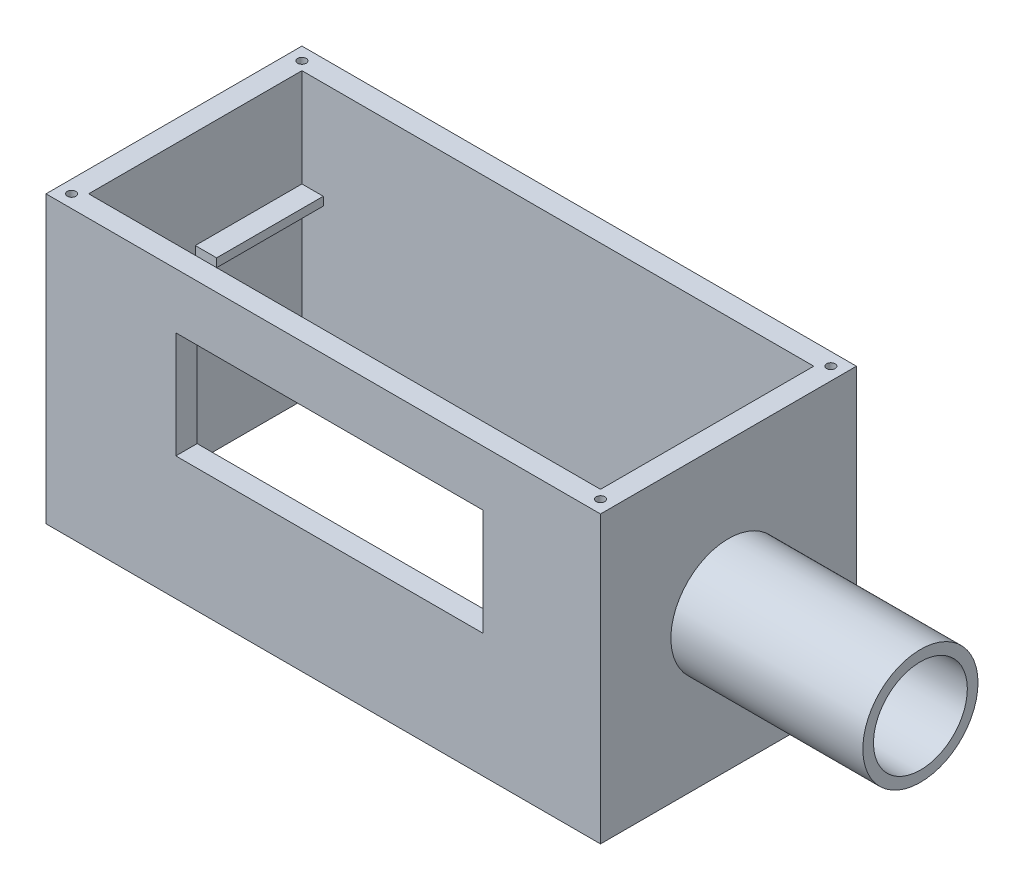
ISO-10303-21;
HEADER;
FILE_DESCRIPTION(('STEP AP214'),'2;1');
FILE_NAME('part.step','',(''),(''),'','','');
FILE_SCHEMA(('AUTOMOTIVE_DESIGN { 1 0 10303 214 1 1 1 1 }'));
ENDSEC;
DATA;
#1=APPLICATION_CONTEXT('core data for automotive mechanical design processes');
#2=APPLICATION_PROTOCOL_DEFINITION('international standard','automotive_design',2000,#1);
#3=PRODUCT_CONTEXT('',#1,'mechanical');
#4=PRODUCT('Part','Part','',(#3));
#5=PRODUCT_RELATED_PRODUCT_CATEGORY('part','',(#4));
#6=PRODUCT_DEFINITION_FORMATION('','',#4);
#7=PRODUCT_DEFINITION_CONTEXT('part definition',#1,'design');
#8=PRODUCT_DEFINITION('design','',#6,#7);
#9=PRODUCT_DEFINITION_SHAPE('','',#8);
#10=(LENGTH_UNIT() NAMED_UNIT(*) SI_UNIT(.MILLI.,.METRE.));
#11=(NAMED_UNIT(*) PLANE_ANGLE_UNIT() SI_UNIT($,.RADIAN.));
#12=(NAMED_UNIT(*) SI_UNIT($,.STERADIAN.) SOLID_ANGLE_UNIT());
#13=UNCERTAINTY_MEASURE_WITH_UNIT(LENGTH_MEASURE(1.E-05),#10,'distance_accuracy_value','');
#14=(GEOMETRIC_REPRESENTATION_CONTEXT(3) GLOBAL_UNCERTAINTY_ASSIGNED_CONTEXT((#13)) GLOBAL_UNIT_ASSIGNED_CONTEXT((#10,
#11,#12)) REPRESENTATION_CONTEXT('',''));
#15=CARTESIAN_POINT('',(0.,0.,0.));
#16=DIRECTION('',(0.,0.,1.));
#17=DIRECTION('',(1.,0.,0.));
#18=AXIS2_PLACEMENT_3D('',#15,#16,#17);
#19=CARTESIAN_POINT('',(-60.,-0.001000000000001,-25.));
#20=DIRECTION('',(0.,0.,-1.));
#21=DIRECTION('',(-1.,0.,0.));
#22=AXIS2_PLACEMENT_3D('',#19,#20,#21);
#23=PLANE('',#22);
#24=DIRECTION('',(1.,0.,0.));
#25=VECTOR('',#24,1.);
#26=CARTESIAN_POINT('',(-60.,42.,-25.));
#27=LINE('',#26,#25);
#28=CARTESIAN_POINT('',(-60.,42.,-25.));
#29=VERTEX_POINT('',#28);
#30=CARTESIAN_POINT('',(-55.,42.,-25.));
#31=VERTEX_POINT('',#30);
#32=EDGE_CURVE('E244',#29,#31,#27,.T.);
#33=ORIENTED_EDGE('',*,*,#32,.F.);
#34=DIRECTION('',(0.,1.,0.));
#35=VECTOR('',#34,1.);
#36=CARTESIAN_POINT('',(-60.,-0.001000000000001,-25.));
#37=LINE('',#36,#35);
#38=CARTESIAN_POINT('',(-60.,0.,-25.));
#39=VERTEX_POINT('',#38);
#40=EDGE_CURVE('E313',#39,#29,#37,.T.);
#41=ORIENTED_EDGE('',*,*,#40,.F.);
#42=DIRECTION('',(1.,0.,0.));
#43=VECTOR('',#42,1.);
#44=CARTESIAN_POINT('',(-60.,0.,-25.));
#45=LINE('',#44,#43);
#46=CARTESIAN_POINT('',(60.,0.,-25.));
#47=VERTEX_POINT('',#46);
#48=EDGE_CURVE('E309',#39,#47,#45,.T.);
#49=ORIENTED_EDGE('',*,*,#48,.T.);
#50=DIRECTION('',(0.,1.,0.));
#51=VECTOR('',#50,1.);
#52=CARTESIAN_POINT('',(60.,-0.001000000000001,-25.));
#53=LINE('',#52,#51);
#54=CARTESIAN_POINT('',(60.,42.,-25.));
#55=VERTEX_POINT('',#54);
#56=EDGE_CURVE('E318',#47,#55,#53,.T.);
#57=ORIENTED_EDGE('',*,*,#56,.T.);
#58=DIRECTION('',(1.,0.,0.));
#59=VECTOR('',#58,1.);
#60=CARTESIAN_POINT('',(-60.,42.,-25.));
#61=LINE('',#60,#59);
#62=CARTESIAN_POINT('',(55.,42.,-25.));
#63=VERTEX_POINT('',#62);
#64=EDGE_CURVE('E375',#63,#55,#61,.T.);
#65=ORIENTED_EDGE('',*,*,#64,.F.);
#66=DIRECTION('',(0.,-1.,0.));
#67=VECTOR('',#66,1.);
#68=CARTESIAN_POINT('',(55.,-0.001000000000001,-25.));
#69=LINE('',#68,#67);
#70=CARTESIAN_POINT('',(55.,44.,-25.));
#71=VERTEX_POINT('',#70);
#72=EDGE_CURVE('E367',#71,#63,#69,.T.);
#73=ORIENTED_EDGE('',*,*,#72,.F.);
#74=DIRECTION('',(-1.,0.,0.));
#75=VECTOR('',#74,1.);
#76=CARTESIAN_POINT('',(-60.,44.,-25.));
#77=LINE('',#76,#75);
#78=CARTESIAN_POINT('',(60.,44.,-25.));
#79=VERTEX_POINT('',#78);
#80=EDGE_CURVE('E371',#79,#71,#77,.T.);
#81=ORIENTED_EDGE('',*,*,#80,.F.);
#82=CARTESIAN_POINT('',(60.,67.,-25.));
#83=VERTEX_POINT('',#82);
#84=EDGE_CURVE('E305',#79,#83,#53,.T.);
#85=ORIENTED_EDGE('',*,*,#84,.T.);
#86=DIRECTION('',(-1.,0.,0.));
#87=VECTOR('',#86,1.);
#88=CARTESIAN_POINT('',(-60.,67.,-25.));
#89=LINE('',#88,#87);
#90=CARTESIAN_POINT('',(-60.,67.,-25.));
#91=VERTEX_POINT('',#90);
#92=EDGE_CURVE('E293',#83,#91,#89,.T.);
#93=ORIENTED_EDGE('',*,*,#92,.T.);
#94=CARTESIAN_POINT('',(-60.,44.,-25.));
#95=VERTEX_POINT('',#94);
#96=EDGE_CURVE('E317',#95,#91,#37,.T.);
#97=ORIENTED_EDGE('',*,*,#96,.F.);
#98=DIRECTION('',(-1.,0.,0.));
#99=VECTOR('',#98,1.);
#100=CARTESIAN_POINT('',(-60.,44.,-25.));
#101=LINE('',#100,#99);
#102=CARTESIAN_POINT('',(-55.,44.,-25.));
#103=VERTEX_POINT('',#102);
#104=EDGE_CURVE('E240',#103,#95,#101,.T.);
#105=ORIENTED_EDGE('',*,*,#104,.F.);
#106=DIRECTION('',(0.,-1.,0.));
#107=VECTOR('',#106,1.);
#108=CARTESIAN_POINT('',(-55.,-0.001000000000001,-25.));
#109=LINE('',#108,#107);
#110=EDGE_CURVE('E43',#103,#31,#109,.T.);
#111=ORIENTED_EDGE('',*,*,#110,.T.);
#112=EDGE_LOOP('',(#33,#41,#49,#57,#65,#73,#81,#85,#93,#97,#105,#111));
#113=FACE_BOUND('',#112,.T.);
#114=ADVANCED_FACE('F39',(#113),#23,.F.);
#115=CARTESIAN_POINT('',(-60.,-0.001000000000001,-25.));
#116=DIRECTION('',(-1.,0.,0.));
#117=DIRECTION('',(0.,0.,1.));
#118=AXIS2_PLACEMENT_3D('',#115,#116,#117);
#119=PLANE('',#118);
#120=DIRECTION('',(0.,0.,-1.));
#121=VECTOR('',#120,1.);
#122=CARTESIAN_POINT('',(-60.,42.,0.));
#123=LINE('',#122,#121);
#124=CARTESIAN_POINT('',(-60.,42.,0.));
#125=VERTEX_POINT('',#124);
#126=EDGE_CURVE('E219',#125,#29,#123,.T.);
#127=ORIENTED_EDGE('',*,*,#126,.F.);
#128=DIRECTION('',(0.,-1.,0.));
#129=VECTOR('',#128,1.);
#130=CARTESIAN_POINT('',(-60.,44.,0.));
#131=LINE('',#130,#129);
#132=CARTESIAN_POINT('',(-60.,44.,0.));
#133=VERTEX_POINT('',#132);
#134=EDGE_CURVE('E213',#133,#125,#131,.T.);
#135=ORIENTED_EDGE('',*,*,#134,.F.);
#136=DIRECTION('',(0.,0.,1.));
#137=VECTOR('',#136,1.);
#138=CARTESIAN_POINT('',(-60.,44.,-25.));
#139=LINE('',#138,#137);
#140=EDGE_CURVE('E378',#95,#133,#139,.T.);
#141=ORIENTED_EDGE('',*,*,#140,.F.);
#142=ORIENTED_EDGE('',*,*,#96,.T.);
#143=DIRECTION('',(0.,0.,1.));
#144=VECTOR('',#143,1.);
#145=CARTESIAN_POINT('',(-60.,67.,-25.));
#146=LINE('',#145,#144);
#147=CARTESIAN_POINT('',(-60.,67.,25.));
#148=VERTEX_POINT('',#147);
#149=EDGE_CURVE('E297',#91,#148,#146,.T.);
#150=ORIENTED_EDGE('',*,*,#149,.T.);
#151=DIRECTION('',(0.,1.,0.));
#152=VECTOR('',#151,1.);
#153=CARTESIAN_POINT('',(-60.,-0.001000000000001,25.));
#154=LINE('',#153,#152);
#155=CARTESIAN_POINT('',(-60.,0.,25.));
#156=VERTEX_POINT('',#155);
#157=EDGE_CURVE('E310',#156,#148,#154,.T.);
#158=ORIENTED_EDGE('',*,*,#157,.F.);
#159=DIRECTION('',(0.,0.,-1.));
#160=VECTOR('',#159,1.);
#161=CARTESIAN_POINT('',(-60.,0.,-25.));
#162=LINE('',#161,#160);
#163=EDGE_CURVE('E278',#156,#39,#162,.T.);
#164=ORIENTED_EDGE('',*,*,#163,.T.);
#165=ORIENTED_EDGE('',*,*,#40,.T.);
#166=EDGE_LOOP('',(#127,#135,#141,#142,#150,#158,#164,#165));
#167=FACE_BOUND('',#166,.T.);
#168=ADVANCED_FACE('F398',(#167),#119,.F.);
#169=CARTESIAN_POINT('',(60.,-0.001000000000001,-25.));
#170=DIRECTION('',(1.,0.,0.));
#171=DIRECTION('',(0.,0.,-1.));
#172=AXIS2_PLACEMENT_3D('',#169,#170,#171);
#173=PLANE('',#172);
#174=DIRECTION('',(0.,0.,1.));
#175=VECTOR('',#174,1.);
#176=CARTESIAN_POINT('',(60.,42.,0.238428507227939));
#177=LINE('',#176,#175);
#178=CARTESIAN_POINT('',(60.,42.,0.238428507227941));
#179=VERTEX_POINT('',#178);
#180=EDGE_CURVE('E248',#55,#179,#177,.T.);
#181=ORIENTED_EDGE('',*,*,#180,.F.);
#182=ORIENTED_EDGE('',*,*,#56,.F.);
#183=DIRECTION('',(0.,0.,1.));
#184=VECTOR('',#183,1.);
#185=CARTESIAN_POINT('',(60.,0.,-25.));
#186=LINE('',#185,#184);
#187=CARTESIAN_POINT('',(60.,0.,25.));
#188=VERTEX_POINT('',#187);
#189=EDGE_CURVE('E285',#47,#188,#186,.T.);
#190=ORIENTED_EDGE('',*,*,#189,.T.);
#191=DIRECTION('',(0.,1.,0.));
#192=VECTOR('',#191,1.);
#193=CARTESIAN_POINT('',(60.,-0.001000000000001,25.));
#194=LINE('',#193,#192);
#195=CARTESIAN_POINT('',(60.,67.,25.));
#196=VERTEX_POINT('',#195);
#197=EDGE_CURVE('E306',#188,#196,#194,.T.);
#198=ORIENTED_EDGE('',*,*,#197,.T.);
#199=DIRECTION('',(0.,0.,-1.));
#200=VECTOR('',#199,1.);
#201=CARTESIAN_POINT('',(60.,67.,-25.));
#202=LINE('',#201,#200);
#203=EDGE_CURVE('E289',#196,#83,#202,.T.);
#204=ORIENTED_EDGE('',*,*,#203,.T.);
#205=ORIENTED_EDGE('',*,*,#84,.F.);
#206=DIRECTION('',(0.,0.,-1.));
#207=VECTOR('',#206,1.);
#208=CARTESIAN_POINT('',(60.,44.,0.238428507227939));
#209=LINE('',#208,#207);
#210=CARTESIAN_POINT('',(60.,44.,0.238428507227939));
#211=VERTEX_POINT('',#210);
#212=EDGE_CURVE('E253',#211,#79,#209,.T.);
#213=ORIENTED_EDGE('',*,*,#212,.F.);
#214=DIRECTION('',(0.,1.,0.));
#215=VECTOR('',#214,1.);
#216=CARTESIAN_POINT('',(60.,44.,0.238428507227939));
#217=LINE('',#216,#215);
#218=EDGE_CURVE('E264',#179,#211,#217,.T.);
#219=ORIENTED_EDGE('',*,*,#218,.F.);
#220=EDGE_LOOP('',(#181,#182,#190,#198,#204,#205,#213,#219));
#221=FACE_BOUND('',#220,.T.);
#222=ADVANCED_FACE('F407',(#221),#173,.F.);
#223=CARTESIAN_POINT('',(65.,67.,-30.));
#224=DIRECTION('',(-1.,0.,0.));
#225=DIRECTION('',(0.,0.,1.));
#226=AXIS2_PLACEMENT_3D('',#223,#224,#225);
#227=PLANE('',#226);
#228=CARTESIAN_POINT('',(65.,33.5,0.));
#229=DIRECTION('',(1.,0.,0.));
#230=DIRECTION('',(0.,0.,-1.));
#231=AXIS2_PLACEMENT_3D('',#228,#229,#230);
#232=CIRCLE('',#231,13.5);
#233=CARTESIAN_POINT('',(65.,33.5,-13.5));
#234=VERTEX_POINT('',#233);
#235=EDGE_CURVE('E11',#234,#234,#232,.T.);
#236=ORIENTED_EDGE('',*,*,#235,.F.);
#237=EDGE_LOOP('',(#236));
#238=FACE_BOUND('',#237,.T.);
#239=DIRECTION('',(0.,0.,-1.));
#240=VECTOR('',#239,1.);
#241=CARTESIAN_POINT('',(65.,0.,-30.));
#242=LINE('',#241,#240);
#243=CARTESIAN_POINT('',(65.,0.,30.));
#244=VERTEX_POINT('',#243);
#245=CARTESIAN_POINT('',(65.,0.,-30.));
#246=VERTEX_POINT('',#245);
#247=EDGE_CURVE('E325',#244,#246,#242,.T.);
#248=ORIENTED_EDGE('',*,*,#247,.T.);
#249=DIRECTION('',(0.,-1.,0.));
#250=VECTOR('',#249,1.);
#251=CARTESIAN_POINT('',(65.,67.,-30.));
#252=LINE('',#251,#250);
#253=CARTESIAN_POINT('',(65.,67.,-30.));
#254=VERTEX_POINT('',#253);
#255=EDGE_CURVE('E363',#254,#246,#252,.T.);
#256=ORIENTED_EDGE('',*,*,#255,.F.);
#257=DIRECTION('',(0.,0.,-1.));
#258=VECTOR('',#257,1.);
#259=CARTESIAN_POINT('',(65.,67.,-30.));
#260=LINE('',#259,#258);
#261=CARTESIAN_POINT('',(65.,67.,30.));
#262=VERTEX_POINT('',#261);
#263=EDGE_CURVE('E326',#262,#254,#260,.T.);
#264=ORIENTED_EDGE('',*,*,#263,.F.);
#265=DIRECTION('',(0.,-1.,0.));
#266=VECTOR('',#265,1.);
#267=CARTESIAN_POINT('',(65.,67.,30.));
#268=LINE('',#267,#266);
#269=EDGE_CURVE('E340',#262,#244,#268,.T.);
#270=ORIENTED_EDGE('',*,*,#269,.T.);
#271=EDGE_LOOP('',(#248,#256,#264,#270));
#272=FACE_BOUND('',#271,.T.);
#273=ADVANCED_FACE('F41',(#238,#272),#227,.F.);
#274=CARTESIAN_POINT('',(-65.,67.,-30.));
#275=DIRECTION('',(0.,0.,1.));
#276=DIRECTION('',(1.,0.,0.));
#277=AXIS2_PLACEMENT_3D('',#274,#275,#276);
#278=PLANE('',#277);
#279=DIRECTION('',(-1.,0.,0.));
#280=VECTOR('',#279,1.);
#281=CARTESIAN_POINT('',(-65.,0.,-30.));
#282=LINE('',#281,#280);
#283=CARTESIAN_POINT('',(-65.,0.,-30.));
#284=VERTEX_POINT('',#283);
#285=EDGE_CURVE('E344',#246,#284,#282,.T.);
#286=ORIENTED_EDGE('',*,*,#285,.T.);
#287=DIRECTION('',(0.,-1.,0.));
#288=VECTOR('',#287,1.);
#289=CARTESIAN_POINT('',(-65.,67.,-30.));
#290=LINE('',#289,#288);
#291=CARTESIAN_POINT('',(-65.,67.,-30.));
#292=VERTEX_POINT('',#291);
#293=EDGE_CURVE('E359',#292,#284,#290,.T.);
#294=ORIENTED_EDGE('',*,*,#293,.F.);
#295=DIRECTION('',(-1.,0.,0.));
#296=VECTOR('',#295,1.);
#297=CARTESIAN_POINT('',(-65.,67.,-30.));
#298=LINE('',#297,#296);
#299=EDGE_CURVE('E330',#254,#292,#298,.T.);
#300=ORIENTED_EDGE('',*,*,#299,.F.);
#301=ORIENTED_EDGE('',*,*,#255,.T.);
#302=EDGE_LOOP('',(#286,#294,#300,#301));
#303=FACE_BOUND('',#302,.T.);
#304=ADVANCED_FACE('F455',(#303),#278,.F.);
#305=CARTESIAN_POINT('',(-65.,67.,-30.));
#306=DIRECTION('',(1.,0.,0.));
#307=DIRECTION('',(0.,0.,-1.));
#308=AXIS2_PLACEMENT_3D('',#305,#306,#307);
#309=PLANE('',#308);
#310=DIRECTION('',(0.,0.,1.));
#311=VECTOR('',#310,1.);
#312=CARTESIAN_POINT('',(-65.,0.,-30.));
#313=LINE('',#312,#311);
#314=CARTESIAN_POINT('',(-65.,0.,30.));
#315=VERTEX_POINT('',#314);
#316=EDGE_CURVE('E347',#284,#315,#313,.T.);
#317=ORIENTED_EDGE('',*,*,#316,.T.);
#318=DIRECTION('',(0.,-1.,0.));
#319=VECTOR('',#318,1.);
#320=CARTESIAN_POINT('',(-65.,67.,30.));
#321=LINE('',#320,#319);
#322=CARTESIAN_POINT('',(-65.,67.,30.));
#323=VERTEX_POINT('',#322);
#324=EDGE_CURVE('E355',#323,#315,#321,.T.);
#325=ORIENTED_EDGE('',*,*,#324,.F.);
#326=DIRECTION('',(0.,0.,1.));
#327=VECTOR('',#326,1.);
#328=CARTESIAN_POINT('',(-65.,67.,-30.));
#329=LINE('',#328,#327);
#330=EDGE_CURVE('E334',#292,#323,#329,.T.);
#331=ORIENTED_EDGE('',*,*,#330,.F.);
#332=ORIENTED_EDGE('',*,*,#293,.T.);
#333=EDGE_LOOP('',(#317,#325,#331,#332));
#334=FACE_BOUND('',#333,.T.);
#335=ADVANCED_FACE('F452',(#334),#309,.F.);
#336=CARTESIAN_POINT('',(-65.,67.,30.));
#337=DIRECTION('',(0.,0.,-1.));
#338=DIRECTION('',(-1.,0.,0.));
#339=AXIS2_PLACEMENT_3D('',#336,#337,#338);
#340=PLANE('',#339);
#341=DIRECTION('',(0.,-1.,0.));
#342=VECTOR('',#341,1.);
#343=CARTESIAN_POINT('',(-34.5641450557704,54.,30.));
#344=LINE('',#343,#342);
#345=CARTESIAN_POINT('',(-34.5641450557704,54.,30.));
#346=VERTEX_POINT('',#345);
#347=CARTESIAN_POINT('',(-34.5641450557704,29.,30.));
#348=VERTEX_POINT('',#347);
#349=EDGE_CURVE('E732',#346,#348,#344,.T.);
#350=ORIENTED_EDGE('',*,*,#349,.F.);
#351=DIRECTION('',(-1.,0.,0.));
#352=VECTOR('',#351,1.);
#353=CARTESIAN_POINT('',(-34.5641450557704,54.,30.));
#354=LINE('',#353,#352);
#355=CARTESIAN_POINT('',(37.4358549442296,54.,30.));
#356=VERTEX_POINT('',#355);
#357=EDGE_CURVE('E736',#356,#346,#354,.T.);
#358=ORIENTED_EDGE('',*,*,#357,.F.);
#359=DIRECTION('',(0.,1.,0.));
#360=VECTOR('',#359,1.);
#361=CARTESIAN_POINT('',(37.4358549442296,54.,30.));
#362=LINE('',#361,#360);
#363=CARTESIAN_POINT('',(37.4358549442296,29.,30.));
#364=VERTEX_POINT('',#363);
#365=EDGE_CURVE('E202',#364,#356,#362,.T.);
#366=ORIENTED_EDGE('',*,*,#365,.F.);
#367=DIRECTION('',(1.,0.,0.));
#368=VECTOR('',#367,1.);
#369=CARTESIAN_POINT('',(-34.5641450557704,29.,30.));
#370=LINE('',#369,#368);
#371=EDGE_CURVE('E56',#348,#364,#370,.T.);
#372=ORIENTED_EDGE('',*,*,#371,.F.);
#373=EDGE_LOOP('',(#350,#358,#366,#372));
#374=FACE_BOUND('',#373,.T.);
#375=DIRECTION('',(1.,0.,0.));
#376=VECTOR('',#375,1.);
#377=CARTESIAN_POINT('',(-65.,0.,30.));
#378=LINE('',#377,#376);
#379=EDGE_CURVE('E331',#315,#244,#378,.T.);
#380=ORIENTED_EDGE('',*,*,#379,.T.);
#381=ORIENTED_EDGE('',*,*,#269,.F.);
#382=DIRECTION('',(1.,0.,0.));
#383=VECTOR('',#382,1.);
#384=CARTESIAN_POINT('',(-65.,67.,30.));
#385=LINE('',#384,#383);
#386=EDGE_CURVE('E337',#323,#262,#385,.T.);
#387=ORIENTED_EDGE('',*,*,#386,.F.);
#388=ORIENTED_EDGE('',*,*,#324,.T.);
#389=EDGE_LOOP('',(#380,#381,#387,#388));
#390=FACE_BOUND('',#389,.T.);
#391=ADVANCED_FACE('F445',(#374,#390),#340,.F.);
#392=CARTESIAN_POINT('',(0.,67.,0.));
#393=DIRECTION('',(0.,1.,0.));
#394=DIRECTION('',(0.,0.,1.));
#395=AXIS2_PLACEMENT_3D('',#392,#393,#394);
#396=PLANE('',#395);
#397=CARTESIAN_POINT('',(62.,67.,-27.));
#398=DIRECTION('',(0.,1.,0.));
#399=DIRECTION('',(0.,0.,-1.));
#400=AXIS2_PLACEMENT_3D('',#397,#398,#399);
#401=CIRCLE('',#400,0.999999999999998);
#402=CARTESIAN_POINT('',(62.,67.,-28.));
#403=VERTEX_POINT('',#402);
#404=EDGE_CURVE('E705',#403,#403,#401,.T.);
#405=ORIENTED_EDGE('',*,*,#404,.F.);
#406=EDGE_LOOP('',(#405));
#407=FACE_BOUND('',#406,.T.);
#408=CARTESIAN_POINT('',(-62.,67.,27.));
#409=DIRECTION('',(0.,1.,0.));
#410=DIRECTION('',(0.,0.,-1.));
#411=AXIS2_PLACEMENT_3D('',#408,#409,#410);
#412=CIRCLE('',#411,0.999999999999998);
#413=CARTESIAN_POINT('',(-62.,67.,26.));
#414=VERTEX_POINT('',#413);
#415=EDGE_CURVE('E704',#414,#414,#412,.T.);
#416=ORIENTED_EDGE('',*,*,#415,.F.);
#417=EDGE_LOOP('',(#416));
#418=FACE_BOUND('',#417,.T.);
#419=CARTESIAN_POINT('',(62.,67.,27.));
#420=DIRECTION('',(0.,1.,0.));
#421=DIRECTION('',(0.,0.,1.));
#422=AXIS2_PLACEMENT_3D('',#419,#420,#421);
#423=CIRCLE('',#422,0.999999999999998);
#424=CARTESIAN_POINT('',(62.,67.,28.));
#425=VERTEX_POINT('',#424);
#426=EDGE_CURVE('E692',#425,#425,#423,.T.);
#427=ORIENTED_EDGE('',*,*,#426,.F.);
#428=EDGE_LOOP('',(#427));
#429=FACE_BOUND('',#428,.T.);
#430=CARTESIAN_POINT('',(-62.,67.,-27.));
#431=DIRECTION('',(0.,1.,0.));
#432=DIRECTION('',(0.,0.,1.));
#433=AXIS2_PLACEMENT_3D('',#430,#431,#432);
#434=CIRCLE('',#433,0.999999999999998);
#435=CARTESIAN_POINT('',(-62.,67.,-26.));
#436=VERTEX_POINT('',#435);
#437=EDGE_CURVE('E714',#436,#436,#434,.T.);
#438=ORIENTED_EDGE('',*,*,#437,.F.);
#439=EDGE_LOOP('',(#438));
#440=FACE_BOUND('',#439,.T.);
#441=ORIENTED_EDGE('',*,*,#203,.F.);
#442=DIRECTION('',(1.,0.,0.));
#443=VECTOR('',#442,1.);
#444=CARTESIAN_POINT('',(-60.,67.,25.));
#445=LINE('',#444,#443);
#446=EDGE_CURVE('E301',#148,#196,#445,.T.);
#447=ORIENTED_EDGE('',*,*,#446,.F.);
#448=ORIENTED_EDGE('',*,*,#149,.F.);
#449=ORIENTED_EDGE('',*,*,#92,.F.);
#450=EDGE_LOOP('',(#441,#447,#448,#449));
#451=FACE_BOUND('',#450,.T.);
#452=ORIENTED_EDGE('',*,*,#263,.T.);
#453=ORIENTED_EDGE('',*,*,#299,.T.);
#454=ORIENTED_EDGE('',*,*,#330,.T.);
#455=ORIENTED_EDGE('',*,*,#386,.T.);
#456=EDGE_LOOP('',(#452,#453,#454,#455));
#457=FACE_BOUND('',#456,.T.);
#458=ADVANCED_FACE('F442',(#407,#418,#429,#440,#451,#457),#396,.T.);
#459=CARTESIAN_POINT('',(0.,0.,0.));
#460=DIRECTION('',(0.,1.,0.));
#461=DIRECTION('',(0.,0.,1.));
#462=AXIS2_PLACEMENT_3D('',#459,#460,#461);
#463=PLANE('',#462);
#464=CARTESIAN_POINT('',(62.,0.,-27.));
#465=DIRECTION('',(0.,1.,0.));
#466=DIRECTION('',(0.,0.,1.));
#467=AXIS2_PLACEMENT_3D('',#464,#465,#466);
#468=CIRCLE('',#467,0.999999999999998);
#469=CARTESIAN_POINT('',(62.,0.,-26.));
#470=VERTEX_POINT('',#469);
#471=EDGE_CURVE('E709',#470,#470,#468,.F.);
#472=ORIENTED_EDGE('',*,*,#471,.F.);
#473=EDGE_LOOP('',(#472));
#474=FACE_BOUND('',#473,.T.);
#475=CARTESIAN_POINT('',(-62.,0.,27.));
#476=DIRECTION('',(0.,1.,0.));
#477=DIRECTION('',(0.,0.,1.));
#478=AXIS2_PLACEMENT_3D('',#475,#476,#477);
#479=CIRCLE('',#478,0.999999999999998);
#480=CARTESIAN_POINT('',(-62.,0.,28.));
#481=VERTEX_POINT('',#480);
#482=EDGE_CURVE('E710',#481,#481,#479,.F.);
#483=ORIENTED_EDGE('',*,*,#482,.F.);
#484=EDGE_LOOP('',(#483));
#485=FACE_BOUND('',#484,.T.);
#486=CARTESIAN_POINT('',(62.,0.,27.));
#487=DIRECTION('',(0.,1.,0.));
#488=DIRECTION('',(0.,0.,1.));
#489=AXIS2_PLACEMENT_3D('',#486,#487,#488);
#490=CIRCLE('',#489,0.999999999999998);
#491=CARTESIAN_POINT('',(62.,0.,28.));
#492=VERTEX_POINT('',#491);
#493=EDGE_CURVE('E700',#492,#492,#490,.F.);
#494=ORIENTED_EDGE('',*,*,#493,.F.);
#495=EDGE_LOOP('',(#494));
#496=FACE_BOUND('',#495,.T.);
#497=CARTESIAN_POINT('',(-62.,0.,-27.));
#498=DIRECTION('',(0.,1.,0.));
#499=DIRECTION('',(0.,0.,1.));
#500=AXIS2_PLACEMENT_3D('',#497,#498,#499);
#501=CIRCLE('',#500,0.999999999999998);
#502=CARTESIAN_POINT('',(-62.,0.,-26.));
#503=VERTEX_POINT('',#502);
#504=EDGE_CURVE('E724',#503,#503,#501,.F.);
#505=ORIENTED_EDGE('',*,*,#504,.F.);
#506=EDGE_LOOP('',(#505));
#507=FACE_BOUND('',#506,.T.);
#508=DIRECTION('',(-1.,0.,0.));
#509=VECTOR('',#508,1.);
#510=CARTESIAN_POINT('',(-60.,0.,25.));
#511=LINE('',#510,#509);
#512=EDGE_CURVE('E281',#188,#156,#511,.T.);
#513=ORIENTED_EDGE('',*,*,#512,.F.);
#514=ORIENTED_EDGE('',*,*,#189,.F.);
#515=ORIENTED_EDGE('',*,*,#48,.F.);
#516=ORIENTED_EDGE('',*,*,#163,.F.);
#517=EDGE_LOOP('',(#513,#514,#515,#516));
#518=FACE_BOUND('',#517,.T.);
#519=ORIENTED_EDGE('',*,*,#247,.F.);
#520=ORIENTED_EDGE('',*,*,#379,.F.);
#521=ORIENTED_EDGE('',*,*,#316,.F.);
#522=ORIENTED_EDGE('',*,*,#285,.F.);
#523=EDGE_LOOP('',(#519,#520,#521,#522));
#524=FACE_BOUND('',#523,.T.);
#525=ADVANCED_FACE('F404',(#474,#485,#496,#507,#518,#524),#463,.F.);
#526=CARTESIAN_POINT('',(-60.,-0.001000000000001,25.));
#527=DIRECTION('',(0.,0.,1.));
#528=DIRECTION('',(1.,0.,0.));
#529=AXIS2_PLACEMENT_3D('',#526,#527,#528);
#530=PLANE('',#529);
#531=DIRECTION('',(0.,-1.,0.));
#532=VECTOR('',#531,1.);
#533=CARTESIAN_POINT('',(37.4358549442296,54.,25.));
#534=LINE('',#533,#532);
#535=CARTESIAN_POINT('',(37.4358549442297,54.,25.));
#536=VERTEX_POINT('',#535);
#537=CARTESIAN_POINT('',(37.4358549442296,29.,25.));
#538=VERTEX_POINT('',#537);
#539=EDGE_CURVE('E190',#536,#538,#534,.T.);
#540=ORIENTED_EDGE('',*,*,#539,.F.);
#541=DIRECTION('',(1.,0.,0.));
#542=VECTOR('',#541,1.);
#543=CARTESIAN_POINT('',(-34.5641450557704,54.,25.));
#544=LINE('',#543,#542);
#545=CARTESIAN_POINT('',(-34.5641450557704,54.,25.));
#546=VERTEX_POINT('',#545);
#547=EDGE_CURVE('E64',#546,#536,#544,.T.);
#548=ORIENTED_EDGE('',*,*,#547,.F.);
#549=DIRECTION('',(0.,1.,0.));
#550=VECTOR('',#549,1.);
#551=CARTESIAN_POINT('',(-34.5641450557704,54.,25.));
#552=LINE('',#551,#550);
#553=CARTESIAN_POINT('',(-34.5641450557704,29.,25.));
#554=VERTEX_POINT('',#553);
#555=EDGE_CURVE('E198',#554,#546,#552,.T.);
#556=ORIENTED_EDGE('',*,*,#555,.F.);
#557=DIRECTION('',(-1.,0.,0.));
#558=VECTOR('',#557,1.);
#559=CARTESIAN_POINT('',(-34.5641450557704,29.,25.));
#560=LINE('',#559,#558);
#561=EDGE_CURVE('E180',#538,#554,#560,.T.);
#562=ORIENTED_EDGE('',*,*,#561,.F.);
#563=EDGE_LOOP('',(#540,#548,#556,#562));
#564=FACE_BOUND('',#563,.T.);
#565=ORIENTED_EDGE('',*,*,#512,.T.);
#566=ORIENTED_EDGE('',*,*,#157,.T.);
#567=ORIENTED_EDGE('',*,*,#446,.T.);
#568=ORIENTED_EDGE('',*,*,#197,.F.);
#569=EDGE_LOOP('',(#565,#566,#567,#568));
#570=FACE_BOUND('',#569,.T.);
#571=ADVANCED_FACE('F195',(#564,#570),#530,.F.);
#572=CARTESIAN_POINT('',(55.,42.,0.238428507227939));
#573=DIRECTION('',(0.,1.,0.));
#574=DIRECTION('',(0.,0.,1.));
#575=AXIS2_PLACEMENT_3D('',#572,#573,#574);
#576=PLANE('',#575);
#577=DIRECTION('',(0.,0.,1.));
#578=VECTOR('',#577,1.);
#579=CARTESIAN_POINT('',(55.,42.,0.238428507227939));
#580=LINE('',#579,#578);
#581=CARTESIAN_POINT('',(55.,42.,0.238428507227939));
#582=VERTEX_POINT('',#581);
#583=EDGE_CURVE('E249',#63,#582,#580,.T.);
#584=ORIENTED_EDGE('',*,*,#583,.F.);
#585=ORIENTED_EDGE('',*,*,#64,.T.);
#586=ORIENTED_EDGE('',*,*,#180,.T.);
#587=DIRECTION('',(1.,0.,0.));
#588=VECTOR('',#587,1.);
#589=CARTESIAN_POINT('',(55.,42.,0.238428507227939));
#590=LINE('',#589,#588);
#591=EDGE_CURVE('E274',#582,#179,#590,.T.);
#592=ORIENTED_EDGE('',*,*,#591,.F.);
#593=EDGE_LOOP('',(#584,#585,#586,#592));
#594=FACE_BOUND('',#593,.T.);
#595=ADVANCED_FACE('F410',(#594),#576,.F.);
#596=CARTESIAN_POINT('',(55.,44.,0.238428507227939));
#597=DIRECTION('',(0.,-1.,0.));
#598=DIRECTION('',(0.,0.,-1.));
#599=AXIS2_PLACEMENT_3D('',#596,#597,#598);
#600=PLANE('',#599);
#601=ORIENTED_EDGE('',*,*,#212,.T.);
#602=ORIENTED_EDGE('',*,*,#80,.T.);
#603=DIRECTION('',(0.,0.,-1.));
#604=VECTOR('',#603,1.);
#605=CARTESIAN_POINT('',(55.,44.,0.238428507227939));
#606=LINE('',#605,#604);
#607=CARTESIAN_POINT('',(55.,44.,0.238428507227939));
#608=VERTEX_POINT('',#607);
#609=EDGE_CURVE('E256',#608,#71,#606,.T.);
#610=ORIENTED_EDGE('',*,*,#609,.F.);
#611=DIRECTION('',(1.,0.,0.));
#612=VECTOR('',#611,1.);
#613=CARTESIAN_POINT('',(55.,44.,0.238428507227939));
#614=LINE('',#613,#612);
#615=EDGE_CURVE('E260',#608,#211,#614,.T.);
#616=ORIENTED_EDGE('',*,*,#615,.T.);
#617=EDGE_LOOP('',(#601,#602,#610,#616));
#618=FACE_BOUND('',#617,.T.);
#619=ADVANCED_FACE('F419',(#618),#600,.F.);
#620=CARTESIAN_POINT('',(55.,0.,0.));
#621=DIRECTION('',(1.,0.,0.));
#622=DIRECTION('',(0.,0.,-1.));
#623=AXIS2_PLACEMENT_3D('',#620,#621,#622);
#624=PLANE('',#623);
#625=ORIENTED_EDGE('',*,*,#609,.T.);
#626=ORIENTED_EDGE('',*,*,#72,.T.);
#627=ORIENTED_EDGE('',*,*,#583,.T.);
#628=DIRECTION('',(0.,1.,0.));
#629=VECTOR('',#628,1.);
#630=CARTESIAN_POINT('',(55.,44.,0.238428507227939));
#631=LINE('',#630,#629);
#632=EDGE_CURVE('E252',#582,#608,#631,.T.);
#633=ORIENTED_EDGE('',*,*,#632,.T.);
#634=EDGE_LOOP('',(#625,#626,#627,#633));
#635=FACE_BOUND('',#634,.T.);
#636=ADVANCED_FACE('F414',(#635),#624,.F.);
#637=CARTESIAN_POINT('',(55.,44.,0.238428507227939));
#638=DIRECTION('',(0.,0.,-1.));
#639=DIRECTION('',(0.,1.,0.));
#640=AXIS2_PLACEMENT_3D('',#637,#638,#639);
#641=PLANE('',#640);
#642=ORIENTED_EDGE('',*,*,#218,.T.);
#643=ORIENTED_EDGE('',*,*,#615,.F.);
#644=ORIENTED_EDGE('',*,*,#632,.F.);
#645=ORIENTED_EDGE('',*,*,#591,.T.);
#646=EDGE_LOOP('',(#642,#643,#644,#645));
#647=FACE_BOUND('',#646,.T.);
#648=ADVANCED_FACE('F421',(#647),#641,.F.);
#649=CARTESIAN_POINT('',(-55.,0.,0.));
#650=DIRECTION('',(1.,0.,0.));
#651=DIRECTION('',(0.,0.,-1.));
#652=AXIS2_PLACEMENT_3D('',#649,#650,#651);
#653=PLANE('',#652);
#654=ORIENTED_EDGE('',*,*,#110,.F.);
#655=DIRECTION('',(0.,0.,1.));
#656=VECTOR('',#655,1.);
#657=CARTESIAN_POINT('',(-55.,44.,0.));
#658=LINE('',#657,#656);
#659=CARTESIAN_POINT('',(-55.,44.,0.));
#660=VERTEX_POINT('',#659);
#661=EDGE_CURVE('E223',#103,#660,#658,.T.);
#662=ORIENTED_EDGE('',*,*,#661,.T.);
#663=DIRECTION('',(0.,-1.,0.));
#664=VECTOR('',#663,1.);
#665=CARTESIAN_POINT('',(-55.,44.,0.));
#666=LINE('',#665,#664);
#667=CARTESIAN_POINT('',(-55.,42.,0.));
#668=VERTEX_POINT('',#667);
#669=EDGE_CURVE('E214',#660,#668,#666,.T.);
#670=ORIENTED_EDGE('',*,*,#669,.T.);
#671=DIRECTION('',(0.,0.,-1.));
#672=VECTOR('',#671,1.);
#673=CARTESIAN_POINT('',(-55.,42.,0.));
#674=LINE('',#673,#672);
#675=EDGE_CURVE('E218',#668,#31,#674,.T.);
#676=ORIENTED_EDGE('',*,*,#675,.T.);
#677=EDGE_LOOP('',(#654,#662,#670,#676));
#678=FACE_BOUND('',#677,.T.);
#679=ADVANCED_FACE('F392',(#678),#653,.T.);
#680=CARTESIAN_POINT('',(-55.,42.,0.));
#681=DIRECTION('',(0.,1.,0.));
#682=DIRECTION('',(0.,0.,1.));
#683=AXIS2_PLACEMENT_3D('',#680,#681,#682);
#684=PLANE('',#683);
#685=ORIENTED_EDGE('',*,*,#126,.T.);
#686=ORIENTED_EDGE('',*,*,#32,.T.);
#687=ORIENTED_EDGE('',*,*,#675,.F.);
#688=DIRECTION('',(-1.,0.,0.));
#689=VECTOR('',#688,1.);
#690=CARTESIAN_POINT('',(-55.,42.,0.));
#691=LINE('',#690,#689);
#692=EDGE_CURVE('E236',#668,#125,#691,.T.);
#693=ORIENTED_EDGE('',*,*,#692,.T.);
#694=EDGE_LOOP('',(#685,#686,#687,#693));
#695=FACE_BOUND('',#694,.T.);
#696=ADVANCED_FACE('F391',(#695),#684,.F.);
#697=CARTESIAN_POINT('',(-55.,44.,0.));
#698=DIRECTION('',(0.,-1.,0.));
#699=DIRECTION('',(0.,0.,-1.));
#700=AXIS2_PLACEMENT_3D('',#697,#698,#699);
#701=PLANE('',#700);
#702=ORIENTED_EDGE('',*,*,#661,.F.);
#703=ORIENTED_EDGE('',*,*,#104,.T.);
#704=ORIENTED_EDGE('',*,*,#140,.T.);
#705=DIRECTION('',(-1.,0.,0.));
#706=VECTOR('',#705,1.);
#707=CARTESIAN_POINT('',(-55.,44.,0.));
#708=LINE('',#707,#706);
#709=EDGE_CURVE('E226',#660,#133,#708,.T.);
#710=ORIENTED_EDGE('',*,*,#709,.F.);
#711=EDGE_LOOP('',(#702,#703,#704,#710));
#712=FACE_BOUND('',#711,.T.);
#713=ADVANCED_FACE('F521',(#712),#701,.F.);
#714=CARTESIAN_POINT('',(-55.,44.,0.));
#715=DIRECTION('',(0.,0.,-1.));
#716=DIRECTION('',(0.,1.,0.));
#717=AXIS2_PLACEMENT_3D('',#714,#715,#716);
#718=PLANE('',#717);
#719=ORIENTED_EDGE('',*,*,#134,.T.);
#720=ORIENTED_EDGE('',*,*,#692,.F.);
#721=ORIENTED_EDGE('',*,*,#669,.F.);
#722=ORIENTED_EDGE('',*,*,#709,.T.);
#723=EDGE_LOOP('',(#719,#720,#721,#722));
#724=FACE_BOUND('',#723,.T.);
#725=ADVANCED_FACE('F396',(#724),#718,.F.);
#726=CARTESIAN_POINT('',(-34.5641450557704,54.,-30.001));
#727=DIRECTION('',(0.,1.,0.));
#728=DIRECTION('',(-1.,0.,0.));
#729=AXIS2_PLACEMENT_3D('',#726,#727,#728);
#730=PLANE('',#729);
#731=ORIENTED_EDGE('',*,*,#547,.T.);
#732=DIRECTION('',(0.,0.,1.));
#733=VECTOR('',#732,1.);
#734=CARTESIAN_POINT('',(37.4358549442296,54.,-30.001));
#735=LINE('',#734,#733);
#736=EDGE_CURVE('E186',#536,#356,#735,.T.);
#737=ORIENTED_EDGE('',*,*,#736,.T.);
#738=ORIENTED_EDGE('',*,*,#357,.T.);
#739=DIRECTION('',(0.,0.,1.));
#740=VECTOR('',#739,1.);
#741=CARTESIAN_POINT('',(-34.5641450557704,54.,-30.001));
#742=LINE('',#741,#740);
#743=EDGE_CURVE('E208',#546,#346,#742,.T.);
#744=ORIENTED_EDGE('',*,*,#743,.F.);
#745=EDGE_LOOP('',(#731,#737,#738,#744));
#746=FACE_BOUND('',#745,.T.);
#747=ADVANCED_FACE('F517',(#746),#730,.F.);
#748=CARTESIAN_POINT('',(-34.5641450557704,54.,-30.001));
#749=DIRECTION('',(-1.,0.,0.));
#750=DIRECTION('',(0.,0.,1.));
#751=AXIS2_PLACEMENT_3D('',#748,#749,#750);
#752=PLANE('',#751);
#753=ORIENTED_EDGE('',*,*,#555,.T.);
#754=ORIENTED_EDGE('',*,*,#743,.T.);
#755=ORIENTED_EDGE('',*,*,#349,.T.);
#756=DIRECTION('',(0.,0.,1.));
#757=VECTOR('',#756,1.);
#758=CARTESIAN_POINT('',(-34.5641450557704,29.,-30.001));
#759=LINE('',#758,#757);
#760=EDGE_CURVE('E187',#554,#348,#759,.T.);
#761=ORIENTED_EDGE('',*,*,#760,.F.);
#762=EDGE_LOOP('',(#753,#754,#755,#761));
#763=FACE_BOUND('',#762,.T.);
#764=ADVANCED_FACE('F514',(#763),#752,.F.);
#765=CARTESIAN_POINT('',(-34.5641450557704,29.,-30.001));
#766=DIRECTION('',(0.,-1.,0.));
#767=DIRECTION('',(0.,0.,-1.));
#768=AXIS2_PLACEMENT_3D('',#765,#766,#767);
#769=PLANE('',#768);
#770=ORIENTED_EDGE('',*,*,#561,.T.);
#771=ORIENTED_EDGE('',*,*,#760,.T.);
#772=ORIENTED_EDGE('',*,*,#371,.T.);
#773=DIRECTION('',(0.,0.,1.));
#774=VECTOR('',#773,1.);
#775=CARTESIAN_POINT('',(37.4358549442296,29.,-30.001));
#776=LINE('',#775,#774);
#777=EDGE_CURVE('E176',#538,#364,#776,.T.);
#778=ORIENTED_EDGE('',*,*,#777,.F.);
#779=EDGE_LOOP('',(#770,#771,#772,#778));
#780=FACE_BOUND('',#779,.T.);
#781=ADVANCED_FACE('F178',(#780),#769,.F.);
#782=CARTESIAN_POINT('',(37.4358549442296,54.,-30.001));
#783=DIRECTION('',(1.,0.,0.));
#784=DIRECTION('',(0.,0.,-1.));
#785=AXIS2_PLACEMENT_3D('',#782,#783,#784);
#786=PLANE('',#785);
#787=ORIENTED_EDGE('',*,*,#539,.T.);
#788=ORIENTED_EDGE('',*,*,#777,.T.);
#789=ORIENTED_EDGE('',*,*,#365,.T.);
#790=ORIENTED_EDGE('',*,*,#736,.F.);
#791=EDGE_LOOP('',(#787,#788,#789,#790));
#792=FACE_BOUND('',#791,.T.);
#793=ADVANCED_FACE('F191',(#792),#786,.F.);
#794=CARTESIAN_POINT('',(-62.,-0.001000000000001,-27.));
#795=DIRECTION('',(0.,1.,0.));
#796=DIRECTION('',(0.,0.,1.));
#797=AXIS2_PLACEMENT_3D('',#794,#795,#796);
#798=CYLINDRICAL_SURFACE('',#797,0.999999999999998);
#799=ORIENTED_EDGE('',*,*,#437,.T.);
#800=EDGE_LOOP('',(#799));
#801=FACE_BOUND('',#800,.T.);
#802=ORIENTED_EDGE('',*,*,#504,.T.);
#803=EDGE_LOOP('',(#802));
#804=FACE_BOUND('',#803,.T.);
#805=ADVANCED_FACE('F501',(#801,#804),#798,.F.);
#806=CARTESIAN_POINT('',(62.,-0.001000000000001,27.));
#807=DIRECTION('',(0.,1.,0.));
#808=DIRECTION('',(0.,0.,1.));
#809=AXIS2_PLACEMENT_3D('',#806,#807,#808);
#810=CYLINDRICAL_SURFACE('',#809,0.999999999999998);
#811=ORIENTED_EDGE('',*,*,#426,.T.);
#812=EDGE_LOOP('',(#811));
#813=FACE_BOUND('',#812,.T.);
#814=ORIENTED_EDGE('',*,*,#493,.T.);
#815=EDGE_LOOP('',(#814));
#816=FACE_BOUND('',#815,.T.);
#817=ADVANCED_FACE('F499',(#813,#816),#810,.F.);
#818=CARTESIAN_POINT('',(-62.,-0.001000000000001,27.));
#819=DIRECTION('',(0.,1.,0.));
#820=DIRECTION('',(0.,0.,1.));
#821=AXIS2_PLACEMENT_3D('',#818,#819,#820);
#822=CYLINDRICAL_SURFACE('',#821,0.999999999999998);
#823=ORIENTED_EDGE('',*,*,#415,.T.);
#824=EDGE_LOOP('',(#823));
#825=FACE_BOUND('',#824,.T.);
#826=ORIENTED_EDGE('',*,*,#482,.T.);
#827=EDGE_LOOP('',(#826));
#828=FACE_BOUND('',#827,.T.);
#829=ADVANCED_FACE('F493',(#825,#828),#822,.F.);
#830=CARTESIAN_POINT('',(62.,-0.001000000000001,-27.));
#831=DIRECTION('',(0.,1.,0.));
#832=DIRECTION('',(0.,0.,1.));
#833=AXIS2_PLACEMENT_3D('',#830,#831,#832);
#834=CYLINDRICAL_SURFACE('',#833,0.999999999999998);
#835=ORIENTED_EDGE('',*,*,#404,.T.);
#836=EDGE_LOOP('',(#835));
#837=FACE_BOUND('',#836,.T.);
#838=ORIENTED_EDGE('',*,*,#471,.T.);
#839=EDGE_LOOP('',(#838));
#840=FACE_BOUND('',#839,.T.);
#841=ADVANCED_FACE('F483',(#837,#840),#834,.F.);
#842=CARTESIAN_POINT('',(110.,33.5,0.));
#843=DIRECTION('',(-1.,0.,0.));
#844=DIRECTION('',(0.,0.,1.));
#845=AXIS2_PLACEMENT_3D('',#842,#843,#844);
#846=CYLINDRICAL_SURFACE('',#845,13.5);
#847=CARTESIAN_POINT('',(110.,33.5,0.));
#848=DIRECTION('',(1.,0.,0.));
#849=DIRECTION('',(0.,0.,-1.));
#850=AXIS2_PLACEMENT_3D('',#847,#848,#849);
#851=CIRCLE('',#850,13.5);
#852=CARTESIAN_POINT('',(110.,33.5,-13.5));
#853=VERTEX_POINT('',#852);
#854=EDGE_CURVE('E686',#853,#853,#851,.T.);
#855=ORIENTED_EDGE('',*,*,#854,.F.);
#856=EDGE_LOOP('',(#855));
#857=FACE_BOUND('',#856,.T.);
#858=ORIENTED_EDGE('',*,*,#235,.T.);
#859=EDGE_LOOP('',(#858));
#860=FACE_BOUND('',#859,.T.);
#861=ADVANCED_FACE('F480',(#857,#860),#846,.T.);
#862=CARTESIAN_POINT('',(110.,33.5,0.));
#863=DIRECTION('',(1.,0.,0.));
#864=DIRECTION('',(0.,0.,-1.));
#865=AXIS2_PLACEMENT_3D('',#862,#863,#864);
#866=PLANE('',#865);
#867=CARTESIAN_POINT('',(110.,33.5,0.));
#868=DIRECTION('',(1.,0.,0.));
#869=DIRECTION('',(0.,0.,-1.));
#870=AXIS2_PLACEMENT_3D('',#867,#868,#869);
#871=CIRCLE('',#870,11.);
#872=CARTESIAN_POINT('',(110.,33.5,-11.));
#873=VERTEX_POINT('',#872);
#874=EDGE_CURVE('E687',#873,#873,#871,.T.);
#875=ORIENTED_EDGE('',*,*,#874,.F.);
#876=EDGE_LOOP('',(#875));
#877=FACE_BOUND('',#876,.T.);
#878=ORIENTED_EDGE('',*,*,#854,.T.);
#879=EDGE_LOOP('',(#878));
#880=FACE_BOUND('',#879,.T.);
#881=ADVANCED_FACE('F482',(#877,#880),#866,.T.);
#882=CARTESIAN_POINT('',(65.,33.5,0.));
#883=DIRECTION('',(1.,0.,0.));
#884=DIRECTION('',(0.,0.,-1.));
#885=AXIS2_PLACEMENT_3D('',#882,#883,#884);
#886=CYLINDRICAL_SURFACE('',#885,11.);
#887=CARTESIAN_POINT('',(65.,33.5,0.));
#888=DIRECTION('',(1.,0.,0.));
#889=DIRECTION('',(0.,0.,-1.));
#890=AXIS2_PLACEMENT_3D('',#887,#888,#889);
#891=CIRCLE('',#890,11.);
#892=CARTESIAN_POINT('',(65.,33.5,-11.));
#893=VERTEX_POINT('',#892);
#894=EDGE_CURVE('E684',#893,#893,#891,.T.);
#895=ORIENTED_EDGE('',*,*,#894,.F.);
#896=EDGE_LOOP('',(#895));
#897=FACE_BOUND('',#896,.T.);
#898=ORIENTED_EDGE('',*,*,#874,.T.);
#899=EDGE_LOOP('',(#898));
#900=FACE_BOUND('',#899,.T.);
#901=ADVANCED_FACE('F490',(#897,#900),#886,.F.);
#902=CARTESIAN_POINT('',(65.,33.5,0.));
#903=DIRECTION('',(1.,0.,0.));
#904=DIRECTION('',(0.,0.,-1.));
#905=AXIS2_PLACEMENT_3D('',#902,#903,#904);
#906=PLANE('',#905);
#907=ORIENTED_EDGE('',*,*,#894,.T.);
#908=EDGE_LOOP('',(#907));
#909=FACE_BOUND('',#908,.T.);
#910=ADVANCED_FACE('F669',(#909),#906,.T.);
#911=CLOSED_SHELL('',(#114,#168,#222,#273,#304,#335,#391,#458,#525,#571,#595,#619,#636,#648,
#679,#696,#713,#725,#747,#764,#781,#793,#805,#817,#829,#841,#861,#881,#901,#910));
#912=MANIFOLD_SOLID_BREP('B2',#911);
#913=ADVANCED_BREP_SHAPE_REPRESENTATION('',(#18,#912),#14);
#914=SHAPE_DEFINITION_REPRESENTATION(#9,#913);
ENDSEC;
END-ISO-10303-21;
